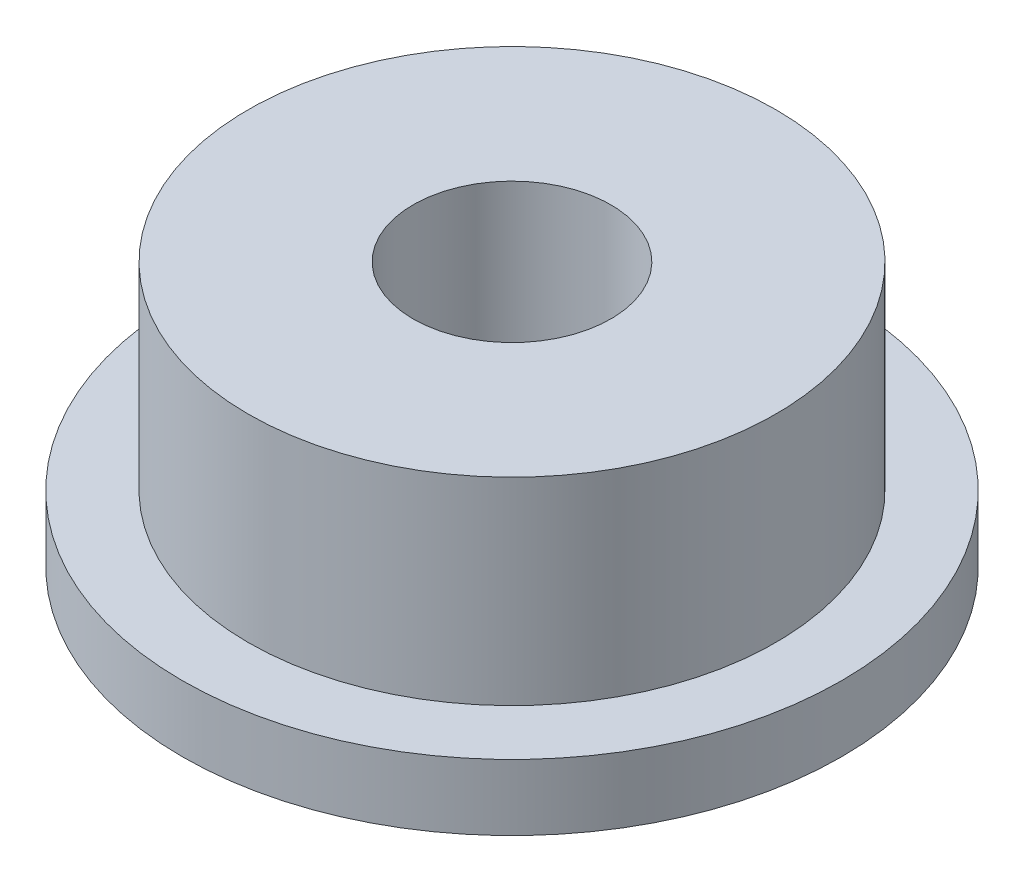
ISO-10303-21;
HEADER;
FILE_DESCRIPTION(('STEP AP214'),'2;1');
FILE_NAME('part.step','',(''),(''),'','','');
FILE_SCHEMA(('AUTOMOTIVE_DESIGN { 1 0 10303 214 1 1 1 1 }'));
ENDSEC;
DATA;
#1=APPLICATION_CONTEXT('core data for automotive mechanical design processes');
#2=APPLICATION_PROTOCOL_DEFINITION('international standard','automotive_design',2000,#1);
#3=PRODUCT_CONTEXT('',#1,'mechanical');
#4=PRODUCT('Part','Part','',(#3));
#5=PRODUCT_RELATED_PRODUCT_CATEGORY('part','',(#4));
#6=PRODUCT_DEFINITION_FORMATION('','',#4);
#7=PRODUCT_DEFINITION_CONTEXT('part definition',#1,'design');
#8=PRODUCT_DEFINITION('design','',#6,#7);
#9=PRODUCT_DEFINITION_SHAPE('','',#8);
#10=(LENGTH_UNIT() NAMED_UNIT(*) SI_UNIT(.MILLI.,.METRE.));
#11=(NAMED_UNIT(*) PLANE_ANGLE_UNIT() SI_UNIT($,.RADIAN.));
#12=(NAMED_UNIT(*) SI_UNIT($,.STERADIAN.) SOLID_ANGLE_UNIT());
#13=UNCERTAINTY_MEASURE_WITH_UNIT(LENGTH_MEASURE(1.E-05),#10,'distance_accuracy_value','');
#14=(GEOMETRIC_REPRESENTATION_CONTEXT(3) GLOBAL_UNCERTAINTY_ASSIGNED_CONTEXT((#13)) GLOBAL_UNIT_ASSIGNED_CONTEXT((#10,
#11,#12)) REPRESENTATION_CONTEXT('',''));
#15=CARTESIAN_POINT('',(0.,0.,0.));
#16=DIRECTION('',(0.,0.,1.));
#17=DIRECTION('',(1.,0.,0.));
#18=AXIS2_PLACEMENT_3D('',#15,#16,#17);
#19=CARTESIAN_POINT('',(1.5,0.,0.));
#20=DIRECTION('',(0.,-1.,0.));
#21=DIRECTION('',(0.,0.,-1.));
#22=AXIS2_PLACEMENT_3D('',#19,#20,#21);
#23=PLANE('',#22);
#24=CARTESIAN_POINT('',(0.,0.,0.));
#25=DIRECTION('',(0.,1.,0.));
#26=DIRECTION('',(0.,0.,1.));
#27=AXIS2_PLACEMENT_3D('',#24,#25,#26);
#28=CIRCLE('',#27,1.5);
#29=CARTESIAN_POINT('',(0.,0.,1.5));
#30=VERTEX_POINT('',#29);
#31=EDGE_CURVE('E62',#30,#30,#28,.T.);
#32=ORIENTED_EDGE('',*,*,#31,.F.);
#33=EDGE_LOOP('',(#32));
#34=FACE_BOUND('',#33,.T.);
#35=CARTESIAN_POINT('',(0.,0.,0.));
#36=DIRECTION('',(0.,1.,0.));
#37=DIRECTION('',(0.,0.,1.));
#38=AXIS2_PLACEMENT_3D('',#35,#36,#37);
#39=CIRCLE('',#38,4.);
#40=CARTESIAN_POINT('',(0.,0.,4.));
#41=VERTEX_POINT('',#40);
#42=EDGE_CURVE('E10',#41,#41,#39,.T.);
#43=ORIENTED_EDGE('',*,*,#42,.T.);
#44=EDGE_LOOP('',(#43));
#45=FACE_BOUND('',#44,.T.);
#46=ADVANCED_FACE('F34',(#34,#45),#23,.F.);
#47=CARTESIAN_POINT('',(0.,0.,0.));
#48=DIRECTION('',(0.,1.,0.));
#49=DIRECTION('',(0.,0.,1.));
#50=AXIS2_PLACEMENT_3D('',#47,#48,#49);
#51=CYLINDRICAL_SURFACE('',#50,4.);
#52=ORIENTED_EDGE('',*,*,#42,.F.);
#53=EDGE_LOOP('',(#52));
#54=FACE_BOUND('',#53,.T.);
#55=CARTESIAN_POINT('',(0.,-3.,0.));
#56=DIRECTION('',(0.,1.,0.));
#57=DIRECTION('',(0.,0.,1.));
#58=AXIS2_PLACEMENT_3D('',#55,#56,#57);
#59=CIRCLE('',#58,4.);
#60=CARTESIAN_POINT('',(0.,-3.,4.));
#61=VERTEX_POINT('',#60);
#62=EDGE_CURVE('E41',#61,#61,#59,.T.);
#63=ORIENTED_EDGE('',*,*,#62,.T.);
#64=EDGE_LOOP('',(#63));
#65=FACE_BOUND('',#64,.T.);
#66=ADVANCED_FACE('F69',(#54,#65),#51,.T.);
#67=CARTESIAN_POINT('',(4.,-3.,0.));
#68=DIRECTION('',(0.,-1.,0.));
#69=DIRECTION('',(0.,0.,-1.));
#70=AXIS2_PLACEMENT_3D('',#67,#68,#69);
#71=PLANE('',#70);
#72=ORIENTED_EDGE('',*,*,#62,.F.);
#73=EDGE_LOOP('',(#72));
#74=FACE_BOUND('',#73,.T.);
#75=CARTESIAN_POINT('',(0.,-3.,0.));
#76=DIRECTION('',(0.,1.,0.));
#77=DIRECTION('',(0.,0.,1.));
#78=AXIS2_PLACEMENT_3D('',#75,#76,#77);
#79=CIRCLE('',#78,5.);
#80=CARTESIAN_POINT('',(0.,-3.,5.));
#81=VERTEX_POINT('',#80);
#82=EDGE_CURVE('E48',#81,#81,#79,.T.);
#83=ORIENTED_EDGE('',*,*,#82,.T.);
#84=EDGE_LOOP('',(#83));
#85=FACE_BOUND('',#84,.T.);
#86=ADVANCED_FACE('F73',(#74,#85),#71,.F.);
#87=CARTESIAN_POINT('',(0.,0.,0.));
#88=DIRECTION('',(0.,1.,0.));
#89=DIRECTION('',(0.,0.,1.));
#90=AXIS2_PLACEMENT_3D('',#87,#88,#89);
#91=CYLINDRICAL_SURFACE('',#90,5.);
#92=ORIENTED_EDGE('',*,*,#82,.F.);
#93=EDGE_LOOP('',(#92));
#94=FACE_BOUND('',#93,.T.);
#95=CARTESIAN_POINT('',(0.,-4.,0.));
#96=DIRECTION('',(0.,1.,0.));
#97=DIRECTION('',(0.,0.,1.));
#98=AXIS2_PLACEMENT_3D('',#95,#96,#97);
#99=CIRCLE('',#98,5.);
#100=CARTESIAN_POINT('',(0.,-4.,5.));
#101=VERTEX_POINT('',#100);
#102=EDGE_CURVE('E54',#101,#101,#99,.T.);
#103=ORIENTED_EDGE('',*,*,#102,.T.);
#104=EDGE_LOOP('',(#103));
#105=FACE_BOUND('',#104,.T.);
#106=ADVANCED_FACE('F78',(#94,#105),#91,.T.);
#107=CARTESIAN_POINT('',(5.,-4.,0.));
#108=DIRECTION('',(0.,1.,0.));
#109=DIRECTION('',(0.,0.,1.));
#110=AXIS2_PLACEMENT_3D('',#107,#108,#109);
#111=PLANE('',#110);
#112=ORIENTED_EDGE('',*,*,#102,.F.);
#113=EDGE_LOOP('',(#112));
#114=FACE_BOUND('',#113,.T.);
#115=CARTESIAN_POINT('',(0.,-4.,0.));
#116=DIRECTION('',(0.,1.,0.));
#117=DIRECTION('',(0.,0.,1.));
#118=AXIS2_PLACEMENT_3D('',#115,#116,#117);
#119=CIRCLE('',#118,1.5);
#120=CARTESIAN_POINT('',(0.,-4.,1.5));
#121=VERTEX_POINT('',#120);
#122=EDGE_CURVE('E59',#121,#121,#119,.T.);
#123=ORIENTED_EDGE('',*,*,#122,.T.);
#124=EDGE_LOOP('',(#123));
#125=FACE_BOUND('',#124,.T.);
#126=ADVANCED_FACE('F84',(#114,#125),#111,.F.);
#127=CARTESIAN_POINT('',(0.,0.,0.));
#128=DIRECTION('',(0.,1.,0.));
#129=DIRECTION('',(0.,0.,1.));
#130=AXIS2_PLACEMENT_3D('',#127,#128,#129);
#131=CYLINDRICAL_SURFACE('',#130,1.5);
#132=ORIENTED_EDGE('',*,*,#122,.F.);
#133=EDGE_LOOP('',(#132));
#134=FACE_BOUND('',#133,.T.);
#135=ORIENTED_EDGE('',*,*,#31,.T.);
#136=EDGE_LOOP('',(#135));
#137=FACE_BOUND('',#136,.T.);
#138=ADVANCED_FACE('F66',(#134,#137),#131,.F.);
#139=CLOSED_SHELL('',(#46,#66,#86,#106,#126,#138));
#140=MANIFOLD_SOLID_BREP('B2',#139);
#141=ADVANCED_BREP_SHAPE_REPRESENTATION('',(#18,#140),#14);
#142=SHAPE_DEFINITION_REPRESENTATION(#9,#141);
ENDSEC;
END-ISO-10303-21;
